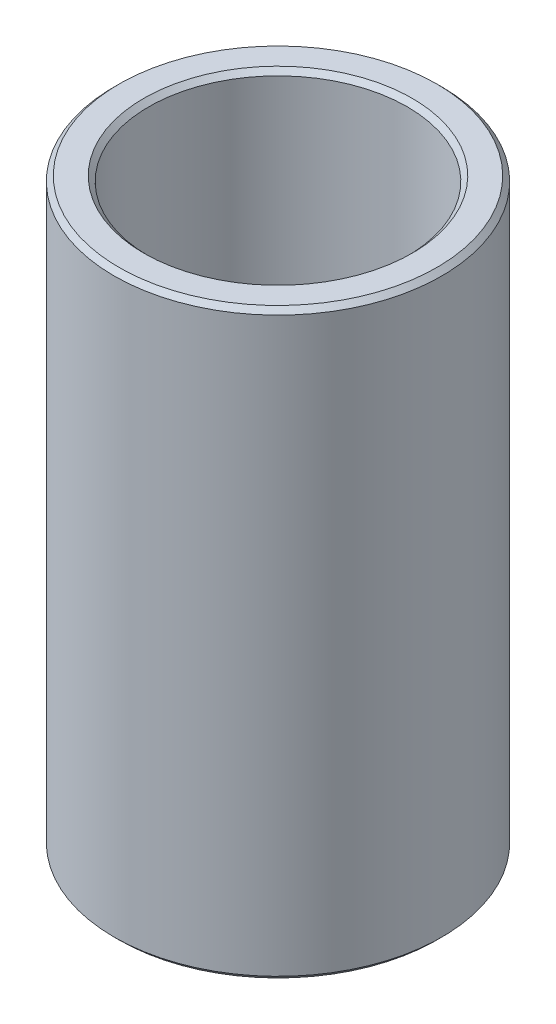
ISO-10303-21;
HEADER;
FILE_DESCRIPTION(('STEP AP214'),'2;1');
FILE_NAME('part.step','',(''),(''),'','','');
FILE_SCHEMA(('AUTOMOTIVE_DESIGN { 1 0 10303 214 1 1 1 1 }'));
ENDSEC;
DATA;
#1=APPLICATION_CONTEXT('core data for automotive mechanical design processes');
#2=APPLICATION_PROTOCOL_DEFINITION('international standard','automotive_design',2000,#1);
#3=PRODUCT_CONTEXT('',#1,'mechanical');
#4=PRODUCT('Part','Part','',(#3));
#5=PRODUCT_RELATED_PRODUCT_CATEGORY('part','',(#4));
#6=PRODUCT_DEFINITION_FORMATION('','',#4);
#7=PRODUCT_DEFINITION_CONTEXT('part definition',#1,'design');
#8=PRODUCT_DEFINITION('design','',#6,#7);
#9=PRODUCT_DEFINITION_SHAPE('','',#8);
#10=(LENGTH_UNIT() NAMED_UNIT(*) SI_UNIT(.MILLI.,.METRE.));
#11=(NAMED_UNIT(*) PLANE_ANGLE_UNIT() SI_UNIT($,.RADIAN.));
#12=(NAMED_UNIT(*) SI_UNIT($,.STERADIAN.) SOLID_ANGLE_UNIT());
#13=UNCERTAINTY_MEASURE_WITH_UNIT(LENGTH_MEASURE(1.E-05),#10,'distance_accuracy_value','');
#14=(GEOMETRIC_REPRESENTATION_CONTEXT(3) GLOBAL_UNCERTAINTY_ASSIGNED_CONTEXT((#13)) GLOBAL_UNIT_ASSIGNED_CONTEXT((#10,
#11,#12)) REPRESENTATION_CONTEXT('',''));
#15=CARTESIAN_POINT('',(0.,0.,0.));
#16=DIRECTION('',(0.,0.,1.));
#17=DIRECTION('',(1.,0.,0.));
#18=AXIS2_PLACEMENT_3D('',#15,#16,#17);
#19=CARTESIAN_POINT('',(0.,168.876734195542,0.));
#20=DIRECTION('',(0.,-1.,0.));
#21=DIRECTION('',(0.,0.,-1.));
#22=AXIS2_PLACEMENT_3D('',#19,#20,#21);
#23=CYLINDRICAL_SURFACE('',#22,47.5);
#24=CARTESIAN_POINT('',(0.,1.42314837287869,0.));
#25=DIRECTION('',(0.,1.,0.));
#26=DIRECTION('',(0.,0.,1.));
#27=AXIS2_PLACEMENT_3D('',#24,#25,#26);
#28=CIRCLE('',#27,47.5);
#29=CARTESIAN_POINT('',(0.,1.42314837287869,47.5));
#30=VERTEX_POINT('',#29);
#31=EDGE_CURVE('E10',#30,#30,#28,.T.);
#32=ORIENTED_EDGE('',*,*,#31,.T.);
#33=EDGE_LOOP('',(#32));
#34=FACE_BOUND('',#33,.T.);
#35=CARTESIAN_POINT('',(0.,167.453585822664,0.));
#36=DIRECTION('',(0.,1.,0.));
#37=DIRECTION('',(0.,0.,1.));
#38=AXIS2_PLACEMENT_3D('',#35,#36,#37);
#39=CIRCLE('',#38,47.5);
#40=CARTESIAN_POINT('',(0.,167.453585822664,-47.5));
#41=VERTEX_POINT('',#40);
#42=EDGE_CURVE('E50',#41,#41,#39,.F.);
#43=ORIENTED_EDGE('',*,*,#42,.T.);
#44=EDGE_LOOP('',(#43));
#45=FACE_BOUND('',#44,.T.);
#46=ADVANCED_FACE('F39',(#34,#45),#23,.T.);
#47=CARTESIAN_POINT('',(0.,168.876734195542,0.));
#48=DIRECTION('',(0.,1.,0.));
#49=DIRECTION('',(0.,0.,1.));
#50=AXIS2_PLACEMENT_3D('',#47,#48,#49);
#51=PLANE('',#50);
#52=CARTESIAN_POINT('',(0.,168.876734195542,0.));
#53=DIRECTION('',(0.,1.,0.));
#54=DIRECTION('',(0.,0.,1.));
#55=AXIS2_PLACEMENT_3D('',#52,#53,#54);
#56=CIRCLE('',#55,38.9126412041362);
#57=CARTESIAN_POINT('',(0.,168.876734195542,38.9126412041362));
#58=VERTEX_POINT('',#57);
#59=EDGE_CURVE('E58',#58,#58,#56,.F.);
#60=ORIENTED_EDGE('',*,*,#59,.T.);
#61=EDGE_LOOP('',(#60));
#62=FACE_BOUND('',#61,.T.);
#63=CARTESIAN_POINT('',(0.,168.876734195542,0.));
#64=DIRECTION('',(0.,1.,0.));
#65=DIRECTION('',(0.,0.,1.));
#66=AXIS2_PLACEMENT_3D('',#63,#64,#65);
#67=CIRCLE('',#66,46.0768516271214);
#68=CARTESIAN_POINT('',(0.,168.876734195542,-46.0768516271214));
#69=VERTEX_POINT('',#68);
#70=EDGE_CURVE('E61',#69,#69,#67,.T.);
#71=ORIENTED_EDGE('',*,*,#70,.T.);
#72=EDGE_LOOP('',(#71));
#73=FACE_BOUND('',#72,.T.);
#74=ADVANCED_FACE('F88',(#62,#73),#51,.T.);
#75=CARTESIAN_POINT('',(0.,0.,0.));
#76=DIRECTION('',(0.,1.,0.));
#77=DIRECTION('',(0.,0.,1.));
#78=AXIS2_PLACEMENT_3D('',#75,#76,#77);
#79=PLANE('',#78);
#80=CARTESIAN_POINT('',(0.,0.,0.));
#81=DIRECTION('',(0.,1.,0.));
#82=DIRECTION('',(0.,0.,1.));
#83=AXIS2_PLACEMENT_3D('',#80,#81,#82);
#84=CIRCLE('',#83,38.9126412041361);
#85=CARTESIAN_POINT('',(0.,0.,38.9126412041361));
#86=VERTEX_POINT('',#85);
#87=EDGE_CURVE('E51',#86,#86,#84,.T.);
#88=ORIENTED_EDGE('',*,*,#87,.T.);
#89=EDGE_LOOP('',(#88));
#90=FACE_BOUND('',#89,.T.);
#91=CARTESIAN_POINT('',(0.,0.,0.));
#92=DIRECTION('',(0.,1.,0.));
#93=DIRECTION('',(0.,0.,1.));
#94=AXIS2_PLACEMENT_3D('',#91,#92,#93);
#95=CIRCLE('',#94,46.0768516271213);
#96=CARTESIAN_POINT('',(0.,0.,46.0768516271213));
#97=VERTEX_POINT('',#96);
#98=EDGE_CURVE('E54',#97,#97,#95,.F.);
#99=ORIENTED_EDGE('',*,*,#98,.T.);
#100=EDGE_LOOP('',(#99));
#101=FACE_BOUND('',#100,.T.);
#102=ADVANCED_FACE('F83',(#90,#101),#79,.F.);
#103=CARTESIAN_POINT('',(0.,168.876734195542,0.));
#104=DIRECTION('',(0.,-1.,0.));
#105=DIRECTION('',(0.,0.,-1.));
#106=AXIS2_PLACEMENT_3D('',#103,#104,#105);
#107=CYLINDRICAL_SURFACE('',#106,37.4894928312574);
#108=CARTESIAN_POINT('',(0.,167.453585822664,0.));
#109=DIRECTION('',(0.,1.,0.));
#110=DIRECTION('',(0.,0.,1.));
#111=AXIS2_PLACEMENT_3D('',#108,#109,#110);
#112=CIRCLE('',#111,37.4894928312574);
#113=CARTESIAN_POINT('',(0.,167.453585822664,37.4894928312574));
#114=VERTEX_POINT('',#113);
#115=EDGE_CURVE('E67',#114,#114,#112,.T.);
#116=ORIENTED_EDGE('',*,*,#115,.T.);
#117=EDGE_LOOP('',(#116));
#118=FACE_BOUND('',#117,.T.);
#119=CARTESIAN_POINT('',(0.,1.42314837287871,0.));
#120=DIRECTION('',(0.,1.,0.));
#121=DIRECTION('',(0.,0.,1.));
#122=AXIS2_PLACEMENT_3D('',#119,#120,#121);
#123=CIRCLE('',#122,37.4894928312574);
#124=CARTESIAN_POINT('',(0.,1.42314837287871,37.4894928312574));
#125=VERTEX_POINT('',#124);
#126=EDGE_CURVE('E69',#125,#125,#123,.F.);
#127=ORIENTED_EDGE('',*,*,#126,.T.);
#128=EDGE_LOOP('',(#127));
#129=FACE_BOUND('',#128,.T.);
#130=ADVANCED_FACE('F71',(#118,#129),#107,.F.);
#131=CARTESIAN_POINT('',(0.,167.453585822664,0.));
#132=DIRECTION('',(0.,1.,0.));
#133=DIRECTION('',(0.,0.,1.));
#134=AXIS2_PLACEMENT_3D('',#131,#132,#133);
#135=CONICAL_SURFACE('',#134,37.4894928312574,0.785398163397451);
#136=ORIENTED_EDGE('',*,*,#59,.F.);
#137=EDGE_LOOP('',(#136));
#138=FACE_BOUND('',#137,.T.);
#139=ORIENTED_EDGE('',*,*,#115,.F.);
#140=EDGE_LOOP('',(#139));
#141=FACE_BOUND('',#140,.T.);
#142=ADVANCED_FACE('F77',(#138,#141),#135,.F.);
#143=CARTESIAN_POINT('',(0.,0.,0.));
#144=DIRECTION('',(0.,-1.,0.));
#145=DIRECTION('',(0.,0.,-1.));
#146=AXIS2_PLACEMENT_3D('',#143,#144,#145);
#147=CONICAL_SURFACE('',#146,38.9126412041361,0.785398163397441);
#148=ORIENTED_EDGE('',*,*,#126,.F.);
#149=EDGE_LOOP('',(#148));
#150=FACE_BOUND('',#149,.T.);
#151=ORIENTED_EDGE('',*,*,#87,.F.);
#152=EDGE_LOOP('',(#151));
#153=FACE_BOUND('',#152,.T.);
#154=ADVANCED_FACE('F73',(#150,#153),#147,.F.);
#155=CARTESIAN_POINT('',(0.,1.42314837287869,0.));
#156=DIRECTION('',(0.,1.,0.));
#157=DIRECTION('',(0.,0.,1.));
#158=AXIS2_PLACEMENT_3D('',#155,#156,#157);
#159=CONICAL_SURFACE('',#158,47.5,0.785398163397451);
#160=ORIENTED_EDGE('',*,*,#98,.F.);
#161=EDGE_LOOP('',(#160));
#162=FACE_BOUND('',#161,.T.);
#163=ORIENTED_EDGE('',*,*,#31,.F.);
#164=EDGE_LOOP('',(#163));
#165=FACE_BOUND('',#164,.T.);
#166=ADVANCED_FACE('F76',(#162,#165),#159,.T.);
#167=CARTESIAN_POINT('',(0.,168.876734195542,0.));
#168=DIRECTION('',(0.,-1.,0.));
#169=DIRECTION('',(0.,0.,-1.));
#170=AXIS2_PLACEMENT_3D('',#167,#168,#169);
#171=CONICAL_SURFACE('',#170,46.0768516271214,0.785398163397446);
#172=CARTESIAN_POINT('',(0.,167.453585822664,-47.5));
#173=CARTESIAN_POINT('',(0.,167.468410284881,-47.4851755377825));
#174=CARTESIAN_POINT('',(0.,167.483234747099,-47.4703510755651));
#175=CARTESIAN_POINT('',(0.,167.512883671534,-47.4407021511301));
#176=CARTESIAN_POINT('',(0.,167.527708133751,-47.4258776889126));
#177=CARTESIAN_POINT('',(0.,167.557357058186,-47.3962287644776));
#178=CARTESIAN_POINT('',(0.,167.572181520403,-47.3814043022601));
#179=CARTESIAN_POINT('',(0.,167.601830444838,-47.3517553778252));
#180=CARTESIAN_POINT('',(0.,167.616654907056,-47.3369309156077));
#181=CARTESIAN_POINT('',(0.,167.646303831491,-47.3072819911727));
#182=CARTESIAN_POINT('',(0.,167.661128293708,-47.2924575289552));
#183=CARTESIAN_POINT('',(0.,167.690777218143,-47.2628086045202));
#184=CARTESIAN_POINT('',(0.,167.705601680361,-47.2479841423028));
#185=CARTESIAN_POINT('',(0.,167.735250604796,-47.2183352178678));
#186=CARTESIAN_POINT('',(0.,167.750075067013,-47.2035107556503));
#187=CARTESIAN_POINT('',(0.,167.779723991448,-47.1738618312153));
#188=CARTESIAN_POINT('',(0.,167.794548453666,-47.1590373689978));
#189=CARTESIAN_POINT('',(0.,167.824197378101,-47.1293884445629));
#190=CARTESIAN_POINT('',(0.,167.839021840318,-47.1145639823454));
#191=CARTESIAN_POINT('',(0.,167.868670764753,-47.0849150579104));
#192=CARTESIAN_POINT('',(0.,167.883495226971,-47.0700905956929));
#193=CARTESIAN_POINT('',(0.,167.913144151406,-47.040441671258));
#194=CARTESIAN_POINT('',(0.,167.927968613623,-47.0256172090405));
#195=CARTESIAN_POINT('',(0.,167.957617538058,-46.9959682846055));
#196=CARTESIAN_POINT('',(0.,167.972442000276,-46.981143822388));
#197=CARTESIAN_POINT('',(0.,168.002090924711,-46.951494897953));
#198=CARTESIAN_POINT('',(0.,168.016915386928,-46.9366704357356));
#199=CARTESIAN_POINT('',(0.,168.046564311363,-46.9070215113006));
#200=CARTESIAN_POINT('',(0.,168.061388773581,-46.8921970490831));
#201=CARTESIAN_POINT('',(0.,168.091037698015,-46.8625481246481));
#202=CARTESIAN_POINT('',(0.,168.105862160233,-46.8477236624306));
#203=CARTESIAN_POINT('',(0.,168.135511084668,-46.8180747379957));
#204=CARTESIAN_POINT('',(0.,168.150335546885,-46.8032502757782));
#205=CARTESIAN_POINT('',(0.,168.17998447132,-46.7736013513432));
#206=CARTESIAN_POINT('',(0.,168.194808933538,-46.7587768891257));
#207=CARTESIAN_POINT('',(0.,168.224457857973,-46.7291279646908));
#208=CARTESIAN_POINT('',(0.,168.23928232019,-46.7143035024733));
#209=CARTESIAN_POINT('',(0.,168.268931244625,-46.6846545780383));
#210=CARTESIAN_POINT('',(0.,168.283755706843,-46.6698301158208));
#211=CARTESIAN_POINT('',(0.,168.313404631278,-46.6401811913858));
#212=CARTESIAN_POINT('',(0.,168.328229093495,-46.6253567291684));
#213=CARTESIAN_POINT('',(0.,168.35787801793,-46.5957078047334));
#214=CARTESIAN_POINT('',(0.,168.372702480148,-46.5808833425159));
#215=CARTESIAN_POINT('',(0.,168.402351404583,-46.5512344180809));
#216=CARTESIAN_POINT('',(0.,168.4171758668,-46.5364099558634));
#217=CARTESIAN_POINT('',(0.,168.446824791235,-46.5067610314285));
#218=CARTESIAN_POINT('',(0.,168.461649253453,-46.491936569211));
#219=CARTESIAN_POINT('',(0.,168.491298177888,-46.462287644776));
#220=CARTESIAN_POINT('',(0.,168.506122640105,-46.4474631825585));
#221=CARTESIAN_POINT('',(0.,168.53577156454,-46.4178142581235));
#222=CARTESIAN_POINT('',(0.,168.550596026758,-46.4029897959061));
#223=CARTESIAN_POINT('',(0.,168.580244951193,-46.3733408714711));
#224=CARTESIAN_POINT('',(0.,168.59506941341,-46.3585164092536));
#225=CARTESIAN_POINT('',(0.,168.624718337845,-46.3288674848186));
#226=CARTESIAN_POINT('',(0.,168.639542800062,-46.3140430226011));
#227=CARTESIAN_POINT('',(0.,168.669191724497,-46.2843940981662));
#228=CARTESIAN_POINT('',(0.,168.684016186715,-46.2695696359487));
#229=CARTESIAN_POINT('',(0.,168.71366511115,-46.2399207115137));
#230=CARTESIAN_POINT('',(0.,168.728489573367,-46.2250962492962));
#231=CARTESIAN_POINT('',(0.,168.758138497802,-46.1954473248613));
#232=CARTESIAN_POINT('',(0.,168.77296296002,-46.1806228626438));
#233=CARTESIAN_POINT('',(0.,168.802611884455,-46.1509739382088));
#234=CARTESIAN_POINT('',(0.,168.817436346672,-46.1361494759913));
#235=CARTESIAN_POINT('',(0.,168.847085271107,-46.1065005515563));
#236=CARTESIAN_POINT('',(0.,168.861909733325,-46.0916760893389));
#237=CARTESIAN_POINT('',(0.,168.876734195542,-46.0768516271214));
#238=B_SPLINE_CURVE_WITH_KNOTS('',3,(#172,#173,#174,#175,#176,#177,#178,#179,#180,#181,#182,
#183,#184,#185,#186,#187,#188,#189,#190,#191,#192,#193,#194,#195,#196,#197,#198,#199,#200,#201,
#202,#203,#204,#205,#206,#207,#208,#209,#210,#211,#212,#213,#214,#215,#216,#217,#218,#219,#220,
#221,#222,#223,#224,#225,#226,#227,#228,#229,#230,#231,#232,#233,#234,#235,#236,#237),
.UNSPECIFIED.,.F.,.F.,(4,2,2,2,2,2,2,2,2,2,2,2,2,2,2,2,2,2,2,2,2,2,2,2,2,2,2,2,2,2,2,2,4),(0.,
0.062894866568581,0.125789733137142,0.188684599705709,0.25157946627429,0.314474332842851,
0.377369199411413,0.440264065979994,0.50315893254856,0.566053799117121,0.628948665685702,
0.691843532254264,0.75473839882283,0.817633265391411,0.880528131959972,0.943422998528534,
1.0063178650971,1.06921273166568,1.13210759823424,1.1950024648028,1.25789733137139,
1.32079219793995,1.38368706450851,1.44658193107709,1.50947679764566,1.57237166421422,
1.6352665307828,1.69816139735136,1.76105626391993,1.82395113048851,1.88684599705707,
1.94974086362563,2.01263573019422),.UNSPECIFIED.);
#239=EDGE_CURVE('BSEAM45',#41,#69,#238,.T.);
#240=ORIENTED_EDGE('',*,*,#42,.F.);
#241=ORIENTED_EDGE('',*,*,#70,.F.);
#242=ORIENTED_EDGE('',*,*,#239,.T.);
#243=ORIENTED_EDGE('',*,*,#239,.F.);
#244=EDGE_LOOP('',(#240,#242,#241,#243));
#245=FACE_BOUND('',#244,.T.);
#246=ADVANCED_FACE('F45',(#245),#171,.T.);
#247=CLOSED_SHELL('',(#46,#74,#102,#130,#142,#154,#166,#246));
#248=MANIFOLD_SOLID_BREP('B2',#247);
#249=ADVANCED_BREP_SHAPE_REPRESENTATION('',(#18,#248),#14);
#250=SHAPE_DEFINITION_REPRESENTATION(#9,#249);
ENDSEC;
END-ISO-10303-21;
